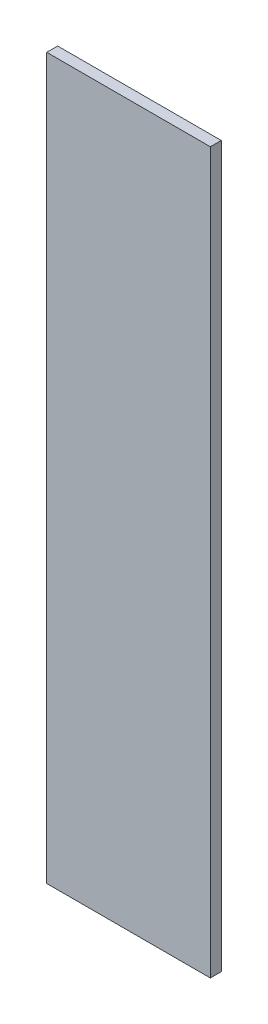
ISO-10303-21;
HEADER;
FILE_DESCRIPTION(('STEP AP214'),'2;1');
FILE_NAME('part.step','',(''),(''),'','','');
FILE_SCHEMA(('AUTOMOTIVE_DESIGN { 1 0 10303 214 1 1 1 1 }'));
ENDSEC;
DATA;
#1=APPLICATION_CONTEXT('core data for automotive mechanical design processes');
#2=APPLICATION_PROTOCOL_DEFINITION('international standard','automotive_design',2000,#1);
#3=PRODUCT_CONTEXT('',#1,'mechanical');
#4=PRODUCT('Part','Part','',(#3));
#5=PRODUCT_RELATED_PRODUCT_CATEGORY('part','',(#4));
#6=PRODUCT_DEFINITION_FORMATION('','',#4);
#7=PRODUCT_DEFINITION_CONTEXT('part definition',#1,'design');
#8=PRODUCT_DEFINITION('design','',#6,#7);
#9=PRODUCT_DEFINITION_SHAPE('','',#8);
#10=(LENGTH_UNIT() NAMED_UNIT(*) SI_UNIT(.MILLI.,.METRE.));
#11=(NAMED_UNIT(*) PLANE_ANGLE_UNIT() SI_UNIT($,.RADIAN.));
#12=(NAMED_UNIT(*) SI_UNIT($,.STERADIAN.) SOLID_ANGLE_UNIT());
#13=UNCERTAINTY_MEASURE_WITH_UNIT(LENGTH_MEASURE(1.E-05),#10,'distance_accuracy_value','');
#14=(GEOMETRIC_REPRESENTATION_CONTEXT(3) GLOBAL_UNCERTAINTY_ASSIGNED_CONTEXT((#13)) GLOBAL_UNIT_ASSIGNED_CONTEXT((#10,
#11,#12)) REPRESENTATION_CONTEXT('',''));
#15=CARTESIAN_POINT('',(0.,0.,0.));
#16=DIRECTION('',(0.,0.,1.));
#17=DIRECTION('',(1.,0.,0.));
#18=AXIS2_PLACEMENT_3D('',#15,#16,#17);
#19=CARTESIAN_POINT('',(95.25,431.8,6.35));
#20=DIRECTION('',(-1.,0.,0.));
#21=DIRECTION('',(0.,-1.,0.));
#22=AXIS2_PLACEMENT_3D('',#19,#20,#21);
#23=PLANE('',#22);
#24=DIRECTION('',(0.,1.,0.));
#25=VECTOR('',#24,1.);
#26=CARTESIAN_POINT('',(95.25,431.8,0.));
#27=LINE('',#26,#25);
#28=CARTESIAN_POINT('',(95.2500000000001,12.7,0.));
#29=VERTEX_POINT('',#28);
#30=CARTESIAN_POINT('',(95.25,431.8,0.));
#31=VERTEX_POINT('',#30);
#32=EDGE_CURVE('E98',#29,#31,#27,.T.);
#33=ORIENTED_EDGE('',*,*,#32,.T.);
#34=DIRECTION('',(0.,0.,-1.));
#35=VECTOR('',#34,1.);
#36=CARTESIAN_POINT('',(95.25,431.8,6.35));
#37=LINE('',#36,#35);
#38=CARTESIAN_POINT('',(95.25,431.8,6.35));
#39=VERTEX_POINT('',#38);
#40=EDGE_CURVE('E11',#39,#31,#37,.T.);
#41=ORIENTED_EDGE('',*,*,#40,.F.);
#42=DIRECTION('',(0.,1.,0.));
#43=VECTOR('',#42,1.);
#44=CARTESIAN_POINT('',(95.25,431.8,6.35));
#45=LINE('',#44,#43);
#46=CARTESIAN_POINT('',(95.2500000000001,12.7,6.35));
#47=VERTEX_POINT('',#46);
#48=EDGE_CURVE('E86',#47,#39,#45,.T.);
#49=ORIENTED_EDGE('',*,*,#48,.F.);
#50=DIRECTION('',(0.,0.,-1.));
#51=VECTOR('',#50,1.);
#52=CARTESIAN_POINT('',(95.2500000000001,12.7,6.35));
#53=LINE('',#52,#51);
#54=EDGE_CURVE('E94',#47,#29,#53,.T.);
#55=ORIENTED_EDGE('',*,*,#54,.T.);
#56=EDGE_LOOP('',(#33,#41,#49,#55));
#57=FACE_BOUND('',#56,.T.);
#58=ADVANCED_FACE('F35',(#57),#23,.F.);
#59=CARTESIAN_POINT('',(0.,431.8,6.35));
#60=DIRECTION('',(0.,-1.,0.));
#61=DIRECTION('',(0.,0.,-1.));
#62=AXIS2_PLACEMENT_3D('',#59,#60,#61);
#63=PLANE('',#62);
#64=DIRECTION('',(-1.,0.,0.));
#65=VECTOR('',#64,1.);
#66=CARTESIAN_POINT('',(0.,431.8,0.));
#67=LINE('',#66,#65);
#68=CARTESIAN_POINT('',(0.,431.8,0.));
#69=VERTEX_POINT('',#68);
#70=EDGE_CURVE('E90',#31,#69,#67,.T.);
#71=ORIENTED_EDGE('',*,*,#70,.T.);
#72=DIRECTION('',(0.,0.,-1.));
#73=VECTOR('',#72,1.);
#74=CARTESIAN_POINT('',(0.,431.8,6.35));
#75=LINE('',#74,#73);
#76=CARTESIAN_POINT('',(0.,431.8,6.35));
#77=VERTEX_POINT('',#76);
#78=EDGE_CURVE('E43',#77,#69,#75,.T.);
#79=ORIENTED_EDGE('',*,*,#78,.F.);
#80=DIRECTION('',(-1.,0.,0.));
#81=VECTOR('',#80,1.);
#82=CARTESIAN_POINT('',(0.,431.8,6.35));
#83=LINE('',#82,#81);
#84=EDGE_CURVE('E81',#39,#77,#83,.T.);
#85=ORIENTED_EDGE('',*,*,#84,.F.);
#86=ORIENTED_EDGE('',*,*,#40,.T.);
#87=EDGE_LOOP('',(#71,#79,#85,#86));
#88=FACE_BOUND('',#87,.T.);
#89=ADVANCED_FACE('F89',(#88),#63,.F.);
#90=CARTESIAN_POINT('',(0.,431.8,6.35));
#91=DIRECTION('',(1.,0.,0.));
#92=DIRECTION('',(0.,1.,0.));
#93=AXIS2_PLACEMENT_3D('',#90,#91,#92);
#94=PLANE('',#93);
#95=DIRECTION('',(0.,-1.,0.));
#96=VECTOR('',#95,1.);
#97=CARTESIAN_POINT('',(0.,431.8,0.));
#98=LINE('',#97,#96);
#99=CARTESIAN_POINT('',(0.,12.7,0.));
#100=VERTEX_POINT('',#99);
#101=EDGE_CURVE('E68',#69,#100,#98,.T.);
#102=ORIENTED_EDGE('',*,*,#101,.T.);
#103=DIRECTION('',(0.,0.,-1.));
#104=VECTOR('',#103,1.);
#105=CARTESIAN_POINT('',(0.,12.7,6.35));
#106=LINE('',#105,#104);
#107=CARTESIAN_POINT('',(0.,12.7,6.35));
#108=VERTEX_POINT('',#107);
#109=EDGE_CURVE('E91',#108,#100,#106,.T.);
#110=ORIENTED_EDGE('',*,*,#109,.F.);
#111=DIRECTION('',(0.,-1.,0.));
#112=VECTOR('',#111,1.);
#113=CARTESIAN_POINT('',(0.,431.8,6.35));
#114=LINE('',#113,#112);
#115=EDGE_CURVE('E84',#77,#108,#114,.T.);
#116=ORIENTED_EDGE('',*,*,#115,.F.);
#117=ORIENTED_EDGE('',*,*,#78,.T.);
#118=EDGE_LOOP('',(#102,#110,#116,#117));
#119=FACE_BOUND('',#118,.T.);
#120=ADVANCED_FACE('F92',(#119),#94,.F.);
#121=CARTESIAN_POINT('',(0.,12.7,6.35));
#122=DIRECTION('',(0.,1.,0.));
#123=DIRECTION('',(0.,0.,1.));
#124=AXIS2_PLACEMENT_3D('',#121,#122,#123);
#125=PLANE('',#124);
#126=DIRECTION('',(1.,0.,0.));
#127=VECTOR('',#126,1.);
#128=CARTESIAN_POINT('',(0.,12.7,0.));
#129=LINE('',#128,#127);
#130=EDGE_CURVE('E74',#100,#29,#129,.T.);
#131=ORIENTED_EDGE('',*,*,#130,.T.);
#132=ORIENTED_EDGE('',*,*,#54,.F.);
#133=DIRECTION('',(1.,0.,0.));
#134=VECTOR('',#133,1.);
#135=CARTESIAN_POINT('',(0.,12.7,6.35));
#136=LINE('',#135,#134);
#137=EDGE_CURVE('E51',#108,#47,#136,.T.);
#138=ORIENTED_EDGE('',*,*,#137,.F.);
#139=ORIENTED_EDGE('',*,*,#109,.T.);
#140=EDGE_LOOP('',(#131,#132,#138,#139));
#141=FACE_BOUND('',#140,.T.);
#142=ADVANCED_FACE('F105',(#141),#125,.F.);
#143=CARTESIAN_POINT('',(0.,0.,6.35));
#144=DIRECTION('',(0.,0.,1.));
#145=DIRECTION('',(1.,0.,0.));
#146=AXIS2_PLACEMENT_3D('',#143,#144,#145);
#147=PLANE('',#146);
#148=ORIENTED_EDGE('',*,*,#48,.T.);
#149=ORIENTED_EDGE('',*,*,#84,.T.);
#150=ORIENTED_EDGE('',*,*,#115,.T.);
#151=ORIENTED_EDGE('',*,*,#137,.T.);
#152=EDGE_LOOP('',(#148,#149,#150,#151));
#153=FACE_BOUND('',#152,.T.);
#154=ADVANCED_FACE('F82',(#153),#147,.T.);
#155=CARTESIAN_POINT('',(0.,0.,0.));
#156=DIRECTION('',(0.,0.,1.));
#157=DIRECTION('',(1.,0.,0.));
#158=AXIS2_PLACEMENT_3D('',#155,#156,#157);
#159=PLANE('',#158);
#160=ORIENTED_EDGE('',*,*,#32,.F.);
#161=ORIENTED_EDGE('',*,*,#130,.F.);
#162=ORIENTED_EDGE('',*,*,#101,.F.);
#163=ORIENTED_EDGE('',*,*,#70,.F.);
#164=EDGE_LOOP('',(#160,#161,#162,#163));
#165=FACE_BOUND('',#164,.T.);
#166=ADVANCED_FACE('F108',(#165),#159,.F.);
#167=CLOSED_SHELL('',(#58,#89,#120,#142,#154,#166));
#168=MANIFOLD_SOLID_BREP('B2',#167);
#169=ADVANCED_BREP_SHAPE_REPRESENTATION('',(#18,#168),#14);
#170=SHAPE_DEFINITION_REPRESENTATION(#9,#169);
ENDSEC;
END-ISO-10303-21;
